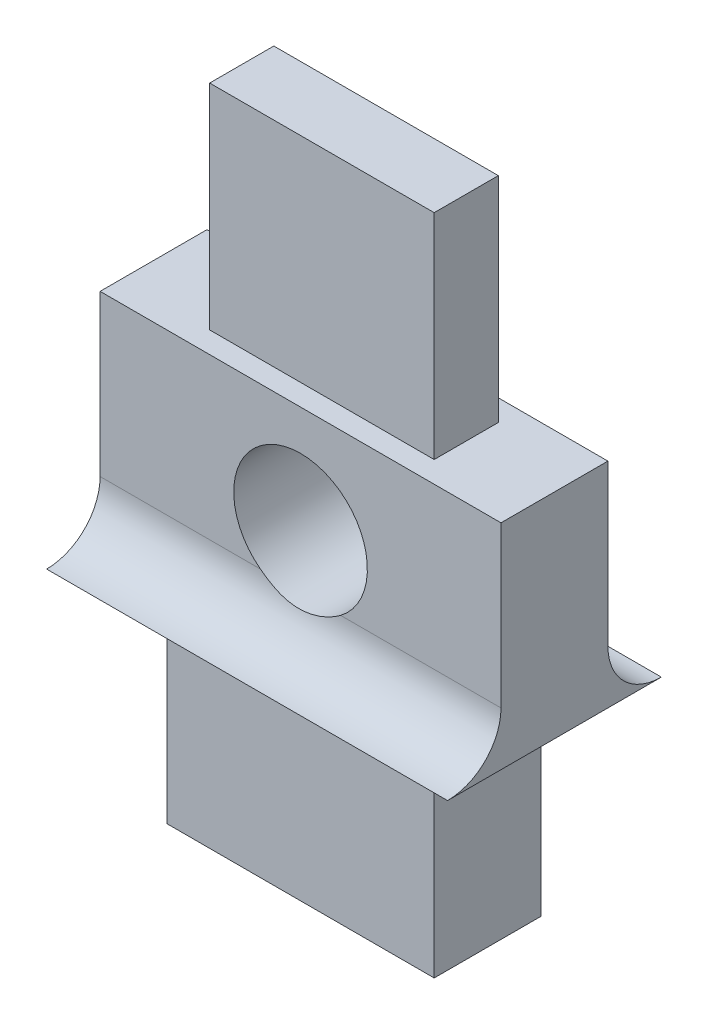
ISO-10303-21;
HEADER;
FILE_DESCRIPTION(('STEP AP214'),'2;1');
FILE_NAME('part.step','',(''),(''),'','','');
FILE_SCHEMA(('AUTOMOTIVE_DESIGN { 1 0 10303 214 1 1 1 1 }'));
ENDSEC;
DATA;
#1=APPLICATION_CONTEXT('core data for automotive mechanical design processes');
#2=APPLICATION_PROTOCOL_DEFINITION('international standard','automotive_design',2000,#1);
#3=PRODUCT_CONTEXT('',#1,'mechanical');
#4=PRODUCT('Part','Part','',(#3));
#5=PRODUCT_RELATED_PRODUCT_CATEGORY('part','',(#4));
#6=PRODUCT_DEFINITION_FORMATION('','',#4);
#7=PRODUCT_DEFINITION_CONTEXT('part definition',#1,'design');
#8=PRODUCT_DEFINITION('design','',#6,#7);
#9=PRODUCT_DEFINITION_SHAPE('','',#8);
#10=(LENGTH_UNIT() NAMED_UNIT(*) SI_UNIT(.MILLI.,.METRE.));
#11=(NAMED_UNIT(*) PLANE_ANGLE_UNIT() SI_UNIT($,.RADIAN.));
#12=(NAMED_UNIT(*) SI_UNIT($,.STERADIAN.) SOLID_ANGLE_UNIT());
#13=UNCERTAINTY_MEASURE_WITH_UNIT(LENGTH_MEASURE(1.E-05),#10,'distance_accuracy_value','');
#14=(GEOMETRIC_REPRESENTATION_CONTEXT(3) GLOBAL_UNCERTAINTY_ASSIGNED_CONTEXT((#13)) GLOBAL_UNIT_ASSIGNED_CONTEXT((#10,
#11,#12)) REPRESENTATION_CONTEXT('',''));
#15=CARTESIAN_POINT('',(0.,0.,0.));
#16=DIRECTION('',(0.,0.,1.));
#17=DIRECTION('',(1.,0.,0.));
#18=AXIS2_PLACEMENT_3D('',#15,#16,#17);
#19=CARTESIAN_POINT('',(0.,0.,0.));
#20=DIRECTION('',(0.,0.,-1.));
#21=DIRECTION('',(-1.,0.,0.));
#22=AXIS2_PLACEMENT_3D('',#19,#20,#21);
#23=PLANE('',#22);
#24=DIRECTION('',(0.,-1.,0.));
#25=VECTOR('',#24,1.);
#26=CARTESIAN_POINT('',(1950.92680872112,1462.88411595094,0.));
#27=LINE('',#26,#25);
#28=CARTESIAN_POINT('',(1950.92680872112,1462.88411595094,0.));
#29=VERTEX_POINT('',#28);
#30=CARTESIAN_POINT('',(1950.92680872112,1459.88411595094,0.));
#31=VERTEX_POINT('',#30);
#32=EDGE_CURVE('E296',#29,#31,#27,.T.);
#33=ORIENTED_EDGE('',*,*,#32,.F.);
#34=DIRECTION('',(-1.,0.,0.));
#35=VECTOR('',#34,1.);
#36=CARTESIAN_POINT('',(1957.17680872112,1462.88411595094,0.));
#37=LINE('',#36,#35);
#38=CARTESIAN_POINT('',(1958.42680872112,1462.88411595094,0.));
#39=VERTEX_POINT('',#38);
#40=EDGE_CURVE('E321',#39,#29,#37,.T.);
#41=ORIENTED_EDGE('',*,*,#40,.F.);
#42=DIRECTION('',(1.11022302462522E-13,1.,0.));
#43=VECTOR('',#42,1.);
#44=CARTESIAN_POINT('',(1958.42680872112,1462.88411595094,0.));
#45=LINE('',#44,#43);
#46=CARTESIAN_POINT('',(1958.42680872112,1459.88411595094,0.));
#47=VERTEX_POINT('',#46);
#48=EDGE_CURVE('E262',#47,#39,#45,.T.);
#49=ORIENTED_EDGE('',*,*,#48,.F.);
#50=DIRECTION('',(-1.,0.,0.));
#51=VECTOR('',#50,1.);
#52=CARTESIAN_POINT('',(1959.84102228349,1459.88411595094,0.));
#53=LINE('',#52,#51);
#54=CARTESIAN_POINT('',(1955.42680872111,1459.88411595094,0.));
#55=VERTEX_POINT('',#54);
#56=EDGE_CURVE('E299',#47,#55,#53,.T.);
#57=ORIENTED_EDGE('',*,*,#56,.T.);
#58=CARTESIAN_POINT('',(1954.67680872112,1460.88411595095,0.));
#59=DIRECTION('',(0.,0.,1.));
#60=DIRECTION('',(1.,0.,0.));
#61=AXIS2_PLACEMENT_3D('',#58,#59,#60);
#62=CIRCLE('',#61,1.24999999999997);
#63=CARTESIAN_POINT('',(1953.92680872112,1459.88411595094,0.));
#64=VERTEX_POINT('',#63);
#65=EDGE_CURVE('E313',#55,#64,#62,.T.);
#66=ORIENTED_EDGE('',*,*,#65,.T.);
#67=EDGE_CURVE('E55',#64,#31,#53,.T.);
#68=ORIENTED_EDGE('',*,*,#67,.T.);
#69=EDGE_LOOP('',(#33,#41,#49,#57,#66,#68));
#70=FACE_BOUND('',#69,.T.);
#71=ADVANCED_FACE('F32',(#70),#23,.T.);
#72=CARTESIAN_POINT('',(0.,0.,2.));
#73=DIRECTION('',(0.,0.,-1.));
#74=DIRECTION('',(-1.,0.,0.));
#75=AXIS2_PLACEMENT_3D('',#72,#73,#74);
#76=PLANE('',#75);
#77=DIRECTION('',(0.,1.,0.));
#78=VECTOR('',#77,1.);
#79=CARTESIAN_POINT('',(1957.17680872112,1458.88411595094,2.));
#80=LINE('',#79,#78);
#81=CARTESIAN_POINT('',(1957.17680872112,1454.88411595094,2.));
#82=VERTEX_POINT('',#81);
#83=CARTESIAN_POINT('',(1957.17680872112,1458.88411595094,2.));
#84=VERTEX_POINT('',#83);
#85=EDGE_CURVE('E328',#82,#84,#80,.T.);
#86=ORIENTED_EDGE('',*,*,#85,.T.);
#87=DIRECTION('',(-1.,0.,0.));
#88=VECTOR('',#87,1.);
#89=CARTESIAN_POINT('',(1959.84102228349,1458.88411595094,2.));
#90=LINE('',#89,#88);
#91=CARTESIAN_POINT('',(1952.17680872112,1458.88411595094,2.));
#92=VERTEX_POINT('',#91);
#93=EDGE_CURVE('E267',#84,#92,#90,.T.);
#94=ORIENTED_EDGE('',*,*,#93,.T.);
#95=DIRECTION('',(-2.22044604925031E-13,-1.,0.));
#96=VECTOR('',#95,1.);
#97=CARTESIAN_POINT('',(1952.17680872112,1458.88411595094,2.));
#98=LINE('',#97,#96);
#99=CARTESIAN_POINT('',(1952.17680872112,1454.88411595094,2.));
#100=VERTEX_POINT('',#99);
#101=EDGE_CURVE('E324',#92,#100,#98,.T.);
#102=ORIENTED_EDGE('',*,*,#101,.T.);
#103=DIRECTION('',(1.,0.,0.));
#104=VECTOR('',#103,1.);
#105=CARTESIAN_POINT('',(1952.17680872112,1454.88411595094,2.));
#106=LINE('',#105,#104);
#107=EDGE_CURVE('E326',#100,#82,#106,.T.);
#108=ORIENTED_EDGE('',*,*,#107,.T.);
#109=EDGE_LOOP('',(#86,#94,#102,#108));
#110=FACE_BOUND('',#109,.T.);
#111=ADVANCED_FACE('F219',(#110),#76,.F.);
#112=DIRECTION('',(1.11022302462522E-13,1.,0.));
#113=VECTOR('',#112,1.);
#114=CARTESIAN_POINT('',(1958.42680872112,1462.88411595094,2.));
#115=LINE('',#114,#113);
#116=CARTESIAN_POINT('',(1958.42680872112,1459.88411595094,2.));
#117=VERTEX_POINT('',#116);
#118=CARTESIAN_POINT('',(1958.42680872112,1462.88411595094,2.));
#119=VERTEX_POINT('',#118);
#120=EDGE_CURVE('E330',#117,#119,#115,.T.);
#121=ORIENTED_EDGE('',*,*,#120,.T.);
#122=DIRECTION('',(-1.,0.,0.));
#123=VECTOR('',#122,1.);
#124=CARTESIAN_POINT('',(1952.17680872112,1462.88411595094,2.));
#125=LINE('',#124,#123);
#126=CARTESIAN_POINT('',(1950.92680872112,1462.88411595094,2.));
#127=VERTEX_POINT('',#126);
#128=EDGE_CURVE('E318',#119,#127,#125,.T.);
#129=ORIENTED_EDGE('',*,*,#128,.T.);
#130=DIRECTION('',(0.,-1.,0.));
#131=VECTOR('',#130,1.);
#132=CARTESIAN_POINT('',(1950.92680872112,1462.88411595094,2.));
#133=LINE('',#132,#131);
#134=CARTESIAN_POINT('',(1950.92680872112,1459.88411595094,2.));
#135=VERTEX_POINT('',#134);
#136=EDGE_CURVE('E320',#127,#135,#133,.T.);
#137=ORIENTED_EDGE('',*,*,#136,.T.);
#138=DIRECTION('',(-1.,0.,0.));
#139=VECTOR('',#138,1.);
#140=CARTESIAN_POINT('',(1959.84102228349,1459.88411595094,2.));
#141=LINE('',#140,#139);
#142=CARTESIAN_POINT('',(1953.92680872112,1459.88411595094,2.));
#143=VERTEX_POINT('',#142);
#144=EDGE_CURVE('E309',#143,#135,#141,.T.);
#145=ORIENTED_EDGE('',*,*,#144,.F.);
#146=CARTESIAN_POINT('',(1954.67680872112,1460.88411595095,2.));
#147=DIRECTION('',(0.,0.,1.));
#148=DIRECTION('',(1.,0.,0.));
#149=AXIS2_PLACEMENT_3D('',#146,#147,#148);
#150=CIRCLE('',#149,1.24999999999997);
#151=CARTESIAN_POINT('',(1955.42680872111,1459.88411595094,2.00000000000006));
#152=VERTEX_POINT('',#151);
#153=EDGE_CURVE('E314',#152,#143,#150,.T.);
#154=ORIENTED_EDGE('',*,*,#153,.F.);
#155=EDGE_CURVE('E306',#117,#152,#141,.T.);
#156=ORIENTED_EDGE('',*,*,#155,.F.);
#157=EDGE_LOOP('',(#121,#129,#137,#145,#154,#156));
#158=FACE_BOUND('',#157,.T.);
#159=ADVANCED_FACE('F227',(#158),#76,.F.);
#160=DIRECTION('',(-1.,0.,0.));
#161=VECTOR('',#160,1.);
#162=CARTESIAN_POINT('',(1959.84102228349,1458.88411595094,0.));
#163=LINE('',#162,#161);
#164=CARTESIAN_POINT('',(1957.17680872112,1458.88411595094,0.));
#165=VERTEX_POINT('',#164);
#166=CARTESIAN_POINT('',(1952.17680872112,1458.88411595094,0.));
#167=VERTEX_POINT('',#166);
#168=EDGE_CURVE('E244',#165,#167,#163,.T.);
#169=ORIENTED_EDGE('',*,*,#168,.F.);
#170=DIRECTION('',(0.,1.,0.));
#171=VECTOR('',#170,1.);
#172=CARTESIAN_POINT('',(1957.17680872112,1458.88411595094,0.));
#173=LINE('',#172,#171);
#174=CARTESIAN_POINT('',(1957.17680872112,1454.88411595094,0.));
#175=VERTEX_POINT('',#174);
#176=EDGE_CURVE('E247',#175,#165,#173,.T.);
#177=ORIENTED_EDGE('',*,*,#176,.F.);
#178=DIRECTION('',(1.,0.,0.));
#179=VECTOR('',#178,1.);
#180=CARTESIAN_POINT('',(1952.17680872112,1454.88411595094,0.));
#181=LINE('',#180,#179);
#182=CARTESIAN_POINT('',(1952.17680872112,1454.88411595094,0.));
#183=VERTEX_POINT('',#182);
#184=EDGE_CURVE('E263',#183,#175,#181,.T.);
#185=ORIENTED_EDGE('',*,*,#184,.F.);
#186=DIRECTION('',(-2.22044604925031E-13,-1.,0.));
#187=VECTOR('',#186,1.);
#188=CARTESIAN_POINT('',(1952.17680872112,1458.88411595094,0.));
#189=LINE('',#188,#187);
#190=EDGE_CURVE('E248',#167,#183,#189,.T.);
#191=ORIENTED_EDGE('',*,*,#190,.F.);
#192=EDGE_LOOP('',(#169,#177,#185,#191));
#193=FACE_BOUND('',#192,.T.);
#194=ADVANCED_FACE('F221',(#193),#23,.T.);
#195=CARTESIAN_POINT('',(1950.92680872112,1462.88411595094,2.));
#196=DIRECTION('',(1.,0.,0.));
#197=DIRECTION('',(0.,0.,-1.));
#198=AXIS2_PLACEMENT_3D('',#195,#196,#197);
#199=PLANE('',#198);
#200=ORIENTED_EDGE('',*,*,#32,.T.);
#201=CARTESIAN_POINT('',(1950.92680872112,1459.88411595094,-1.));
#202=DIRECTION('',(1.,0.,0.));
#203=DIRECTION('',(0.,0.,-1.));
#204=AXIS2_PLACEMENT_3D('',#201,#202,#203);
#205=CIRCLE('',#204,0.999999999999945);
#206=CARTESIAN_POINT('',(1950.92680872112,1458.88411595094,-1.));
#207=VERTEX_POINT('',#206);
#208=EDGE_CURVE('E291',#31,#207,#205,.T.);
#209=ORIENTED_EDGE('',*,*,#208,.T.);
#210=DIRECTION('',(0.,0.,-1.));
#211=VECTOR('',#210,1.);
#212=CARTESIAN_POINT('',(1950.92680872112,1458.88411595094,2.));
#213=LINE('',#212,#211);
#214=CARTESIAN_POINT('',(1950.92680872112,1458.88411595094,3.));
#215=VERTEX_POINT('',#214);
#216=EDGE_CURVE('E40',#215,#207,#213,.T.);
#217=ORIENTED_EDGE('',*,*,#216,.F.);
#218=CARTESIAN_POINT('',(1950.92680872112,1459.88411595094,3.));
#219=DIRECTION('',(1.,0.,0.));
#220=DIRECTION('',(0.,0.,1.));
#221=AXIS2_PLACEMENT_3D('',#218,#219,#220);
#222=CIRCLE('',#221,0.999999999999945);
#223=EDGE_CURVE('E302',#215,#135,#222,.T.);
#224=ORIENTED_EDGE('',*,*,#223,.T.);
#225=ORIENTED_EDGE('',*,*,#136,.F.);
#226=DIRECTION('',(0.,0.,-1.));
#227=VECTOR('',#226,1.);
#228=CARTESIAN_POINT('',(1950.92680872112,1462.88411595094,2.));
#229=LINE('',#228,#227);
#230=EDGE_CURVE('E11',#127,#29,#229,.T.);
#231=ORIENTED_EDGE('',*,*,#230,.T.);
#232=EDGE_LOOP('',(#200,#209,#217,#224,#225,#231));
#233=FACE_BOUND('',#232,.T.);
#234=ADVANCED_FACE('F232',(#233),#199,.F.);
#235=CARTESIAN_POINT('',(1952.17680872112,1458.88411595094,2.));
#236=DIRECTION('',(1.,-2.22044604925031E-13,0.));
#237=DIRECTION('',(2.22044604925031E-13,1.,0.));
#238=AXIS2_PLACEMENT_3D('',#235,#236,#237);
#239=PLANE('',#238);
#240=ORIENTED_EDGE('',*,*,#190,.T.);
#241=DIRECTION('',(0.,0.,-1.));
#242=VECTOR('',#241,1.);
#243=CARTESIAN_POINT('',(1952.17680872112,1454.88411595094,2.));
#244=LINE('',#243,#242);
#245=EDGE_CURVE('E271',#100,#183,#244,.T.);
#246=ORIENTED_EDGE('',*,*,#245,.F.);
#247=ORIENTED_EDGE('',*,*,#101,.F.);
#248=DIRECTION('',(0.,0.,-1.));
#249=VECTOR('',#248,1.);
#250=CARTESIAN_POINT('',(1952.17680872112,1458.88411595094,2.));
#251=LINE('',#250,#249);
#252=EDGE_CURVE('E279',#92,#167,#251,.T.);
#253=ORIENTED_EDGE('',*,*,#252,.T.);
#254=EDGE_LOOP('',(#240,#246,#247,#253));
#255=FACE_BOUND('',#254,.T.);
#256=ADVANCED_FACE('F238',(#255),#239,.F.);
#257=CARTESIAN_POINT('',(1952.17680872112,1454.88411595094,2.));
#258=DIRECTION('',(0.,1.,0.));
#259=DIRECTION('',(0.,0.,1.));
#260=AXIS2_PLACEMENT_3D('',#257,#258,#259);
#261=PLANE('',#260);
#262=ORIENTED_EDGE('',*,*,#184,.T.);
#263=DIRECTION('',(0.,0.,-1.));
#264=VECTOR('',#263,1.);
#265=CARTESIAN_POINT('',(1957.17680872112,1454.88411595094,2.));
#266=LINE('',#265,#264);
#267=EDGE_CURVE('E261',#82,#175,#266,.T.);
#268=ORIENTED_EDGE('',*,*,#267,.F.);
#269=ORIENTED_EDGE('',*,*,#107,.F.);
#270=ORIENTED_EDGE('',*,*,#245,.T.);
#271=EDGE_LOOP('',(#262,#268,#269,#270));
#272=FACE_BOUND('',#271,.T.);
#273=ADVANCED_FACE('F372',(#272),#261,.F.);
#274=CARTESIAN_POINT('',(1957.17680872112,1458.88411595094,2.));
#275=DIRECTION('',(-1.,0.,0.));
#276=DIRECTION('',(0.,0.,1.));
#277=AXIS2_PLACEMENT_3D('',#274,#275,#276);
#278=PLANE('',#277);
#279=ORIENTED_EDGE('',*,*,#176,.T.);
#280=DIRECTION('',(0.,0.,-1.));
#281=VECTOR('',#280,1.);
#282=CARTESIAN_POINT('',(1957.17680872112,1458.88411595094,2.));
#283=LINE('',#282,#281);
#284=EDGE_CURVE('E259',#84,#165,#283,.T.);
#285=ORIENTED_EDGE('',*,*,#284,.F.);
#286=ORIENTED_EDGE('',*,*,#85,.F.);
#287=ORIENTED_EDGE('',*,*,#267,.T.);
#288=EDGE_LOOP('',(#279,#285,#286,#287));
#289=FACE_BOUND('',#288,.T.);
#290=ADVANCED_FACE('F257',(#289),#278,.F.);
#291=CARTESIAN_POINT('',(1957.17680872112,1458.88411595094,2.));
#292=DIRECTION('',(0.,1.,0.));
#293=DIRECTION('',(0.,0.,1.));
#294=AXIS2_PLACEMENT_3D('',#291,#292,#293);
#295=PLANE('',#294);
#296=ORIENTED_EDGE('',*,*,#168,.T.);
#297=ORIENTED_EDGE('',*,*,#252,.F.);
#298=ORIENTED_EDGE('',*,*,#93,.F.);
#299=ORIENTED_EDGE('',*,*,#284,.T.);
#300=EDGE_LOOP('',(#296,#297,#298,#299));
#301=FACE_BOUND('',#300,.T.);
#302=ORIENTED_EDGE('',*,*,#216,.T.);
#303=DIRECTION('',(-1.,0.,0.));
#304=VECTOR('',#303,1.);
#305=CARTESIAN_POINT('',(1959.84102228349,1458.88411595094,-1.));
#306=LINE('',#305,#304);
#307=CARTESIAN_POINT('',(1958.42680872112,1458.88411595094,-1.));
#308=VERTEX_POINT('',#307);
#309=EDGE_CURVE('E252',#308,#207,#306,.T.);
#310=ORIENTED_EDGE('',*,*,#309,.F.);
#311=DIRECTION('',(0.,0.,-1.));
#312=VECTOR('',#311,1.);
#313=CARTESIAN_POINT('',(1958.42680872112,1458.88411595094,2.));
#314=LINE('',#313,#312);
#315=CARTESIAN_POINT('',(1958.42680872112,1458.88411595094,3.));
#316=VERTEX_POINT('',#315);
#317=EDGE_CURVE('E269',#316,#308,#314,.T.);
#318=ORIENTED_EDGE('',*,*,#317,.F.);
#319=DIRECTION('',(-1.,0.,0.));
#320=VECTOR('',#319,1.);
#321=CARTESIAN_POINT('',(1959.84102228349,1458.88411595094,3.));
#322=LINE('',#321,#320);
#323=EDGE_CURVE('E284',#316,#215,#322,.T.);
#324=ORIENTED_EDGE('',*,*,#323,.T.);
#325=EDGE_LOOP('',(#302,#310,#318,#324));
#326=FACE_BOUND('',#325,.T.);
#327=ADVANCED_FACE('F265',(#301,#326),#295,.F.);
#328=CARTESIAN_POINT('',(1958.42680872112,1462.88411595094,2.));
#329=DIRECTION('',(-1.,1.11022302462522E-13,0.));
#330=DIRECTION('',(-1.11022302462522E-13,-1.,0.));
#331=AXIS2_PLACEMENT_3D('',#328,#329,#330);
#332=PLANE('',#331);
#333=ORIENTED_EDGE('',*,*,#317,.T.);
#334=CARTESIAN_POINT('',(1958.42680872112,1459.88411595094,-1.));
#335=DIRECTION('',(-1.,1.11022302462522E-13,0.));
#336=DIRECTION('',(-1.11022302462522E-13,-1.,0.));
#337=AXIS2_PLACEMENT_3D('',#334,#335,#336);
#338=CIRCLE('',#337,0.999999999999945);
#339=EDGE_CURVE('E294',#308,#47,#338,.T.);
#340=ORIENTED_EDGE('',*,*,#339,.T.);
#341=ORIENTED_EDGE('',*,*,#48,.T.);
#342=DIRECTION('',(0.,0.,-1.));
#343=VECTOR('',#342,1.);
#344=CARTESIAN_POINT('',(1958.42680872112,1462.88411595094,2.));
#345=LINE('',#344,#343);
#346=EDGE_CURVE('E273',#119,#39,#345,.T.);
#347=ORIENTED_EDGE('',*,*,#346,.F.);
#348=ORIENTED_EDGE('',*,*,#120,.F.);
#349=CARTESIAN_POINT('',(1958.42680872112,1459.88411595094,3.));
#350=DIRECTION('',(-1.,1.11022302462522E-13,0.));
#351=DIRECTION('',(-1.11022302462522E-13,-1.,0.));
#352=AXIS2_PLACEMENT_3D('',#349,#350,#351);
#353=CIRCLE('',#352,0.999999999999945);
#354=EDGE_CURVE('E305',#117,#316,#353,.T.);
#355=ORIENTED_EDGE('',*,*,#354,.T.);
#356=EDGE_LOOP('',(#333,#340,#341,#347,#348,#355));
#357=FACE_BOUND('',#356,.T.);
#358=ADVANCED_FACE('F344',(#357),#332,.F.);
#359=CARTESIAN_POINT('',(1957.17680872112,1462.88411595094,2.));
#360=DIRECTION('',(0.,-1.,0.));
#361=DIRECTION('',(0.,0.,-1.));
#362=AXIS2_PLACEMENT_3D('',#359,#360,#361);
#363=PLANE('',#362);
#364=ORIENTED_EDGE('',*,*,#40,.T.);
#365=ORIENTED_EDGE('',*,*,#230,.F.);
#366=ORIENTED_EDGE('',*,*,#128,.F.);
#367=ORIENTED_EDGE('',*,*,#346,.T.);
#368=EDGE_LOOP('',(#364,#365,#366,#367));
#369=FACE_BOUND('',#368,.T.);
#370=DIRECTION('',(0.,0.,1.));
#371=VECTOR('',#370,1.);
#372=CARTESIAN_POINT('',(1952.57680872112,1462.88411595094,1.6));
#373=LINE('',#372,#371);
#374=CARTESIAN_POINT('',(1952.57680872112,1462.88411595094,0.4));
#375=VERTEX_POINT('',#374);
#376=CARTESIAN_POINT('',(1952.57680872112,1462.88411595094,1.6));
#377=VERTEX_POINT('',#376);
#378=EDGE_CURVE('E165',#375,#377,#373,.T.);
#379=ORIENTED_EDGE('',*,*,#378,.F.);
#380=DIRECTION('',(-1.,0.,0.));
#381=VECTOR('',#380,1.);
#382=CARTESIAN_POINT('',(1952.57680872112,1462.88411595094,0.4));
#383=LINE('',#382,#381);
#384=CARTESIAN_POINT('',(1956.77680872112,1462.88411595094,0.4));
#385=VERTEX_POINT('',#384);
#386=EDGE_CURVE('E159',#385,#375,#383,.T.);
#387=ORIENTED_EDGE('',*,*,#386,.F.);
#388=DIRECTION('',(0.,0.,-1.));
#389=VECTOR('',#388,1.);
#390=CARTESIAN_POINT('',(1956.77680872112,1462.88411595094,1.6));
#391=LINE('',#390,#389);
#392=CARTESIAN_POINT('',(1956.77680872112,1462.88411595094,1.6));
#393=VERTEX_POINT('',#392);
#394=EDGE_CURVE('E168',#393,#385,#391,.T.);
#395=ORIENTED_EDGE('',*,*,#394,.F.);
#396=DIRECTION('',(1.,0.,0.));
#397=VECTOR('',#396,1.);
#398=CARTESIAN_POINT('',(1952.57680872112,1462.88411595094,1.6));
#399=LINE('',#398,#397);
#400=EDGE_CURVE('E151',#377,#393,#399,.T.);
#401=ORIENTED_EDGE('',*,*,#400,.F.);
#402=EDGE_LOOP('',(#379,#387,#395,#401));
#403=FACE_BOUND('',#402,.T.);
#404=ADVANCED_FACE('F163',(#369,#403),#363,.F.);
#405=CARTESIAN_POINT('',(1954.67680872112,1460.88411595095,2.));
#406=DIRECTION('',(0.,0.,-1.));
#407=DIRECTION('',(-1.,0.,0.));
#408=AXIS2_PLACEMENT_3D('',#405,#406,#407);
#409=CYLINDRICAL_SURFACE('',#408,1.24999999999997);
#410=ORIENTED_EDGE('',*,*,#153,.T.);
#411=CARTESIAN_POINT('',(1953.92680872112,1459.88411595094,2.00000000000006));
#412=CARTESIAN_POINT('',(1953.95464186426,1459.86324053161,2.00000413601019));
#413=CARTESIAN_POINT('',(1953.98332445631,1459.84354558404,2.00065286249592));
#414=CARTESIAN_POINT('',(1954.04219362052,1459.80663247636,2.00283435504111));
#415=CARTESIAN_POINT('',(1954.07237951385,1459.78941321175,2.00436672532793));
#416=CARTESIAN_POINT('',(1954.16493643226,1459.74161719196,2.00968314842704));
#417=CARTESIAN_POINT('',(1954.22930871718,1459.71490069901,2.01418657178201));
#418=CARTESIAN_POINT('',(1954.36159209563,1459.67251971499,2.02240246556453));
#419=CARTESIAN_POINT('',(1954.42950212547,1459.65685192226,2.02611517204895));
#420=CARTESIAN_POINT('',(1954.56700929288,1459.63701636227,2.03095427102973));
#421=CARTESIAN_POINT('',(1954.63660414283,1459.63283379689,2.03208399125503));
#422=CARTESIAN_POINT('',(1954.77504472976,1459.63607168941,2.03125053742804));
#423=CARTESIAN_POINT('',(1954.84389239719,1459.64341702368,2.02930738765252));
#424=CARTESIAN_POINT('',(1954.97939950408,1459.66933001508,2.02324979340273));
#425=CARTESIAN_POINT('',(1955.04605666205,1459.68790900477,2.01913315683881));
#426=CARTESIAN_POINT('',(1955.16719027573,1459.7327467703,2.01129786180112));
#427=CARTESIAN_POINT('',(1955.2221396564,1459.75773340367,2.00759490859268));
#428=CARTESIAN_POINT('',(1955.30142399057,1459.80094387527,2.00336036664711));
#429=CARTESIAN_POINT('',(1955.32731779593,1459.816294206,2.00216907514131));
#430=CARTESIAN_POINT('',(1955.3779580889,1459.84884011021,2.00048997066709));
#431=CARTESIAN_POINT('',(1955.40270404076,1459.86603653315,2.00000248305203));
#432=CARTESIAN_POINT('',(1955.42680872111,1459.88411595094,2.00000000000006));
#433=B_SPLINE_CURVE_WITH_KNOTS('',3,(#411,#412,#413,#414,#415,#416,#417,#418,#419,#420,#421,
#422,#423,#424,#425,#426,#427,#428,#429,#430,#431,#432),.UNSPECIFIED.,.F.,.F.,(4,2,2,2,2,2,2,2,
2,2,4),(0.,0.104289480114433,0.208532286557596,0.417010423227884,0.625426234310823,
0.833573386174511,1.04036973220732,1.24737504408885,1.42813829488587,1.51843817128817,
1.60877977802348),.UNSPECIFIED.);
#434=EDGE_CURVE('E194',#143,#152,#433,.T.);
#435=ORIENTED_EDGE('',*,*,#434,.T.);
#436=EDGE_LOOP('',(#410,#435));
#437=FACE_BOUND('',#436,.T.);
#438=ORIENTED_EDGE('',*,*,#65,.F.);
#439=CARTESIAN_POINT('',(1955.42680872111,1459.88411595094,0.));
#440=CARTESIAN_POINT('',(1955.39897557797,1459.86324053161,-4.13601018518848E-06));
#441=CARTESIAN_POINT('',(1955.37029298592,1459.84354558404,-0.00065286249591931));
#442=CARTESIAN_POINT('',(1955.31142382171,1459.80663247636,-0.00283435504112357));
#443=CARTESIAN_POINT('',(1955.28123792838,1459.78941321175,-0.00436672532794736));
#444=CARTESIAN_POINT('',(1955.18868100997,1459.74161719196,-0.00968314842705621));
#445=CARTESIAN_POINT('',(1955.12430872505,1459.71490069901,-0.0141865717820136));
#446=CARTESIAN_POINT('',(1954.9920253466,1459.67251971499,-0.0224024655645303));
#447=CARTESIAN_POINT('',(1954.92411531676,1459.65685192226,-0.0261151720489534));
#448=CARTESIAN_POINT('',(1954.78660814936,1459.63701636227,-0.0309542710297293));
#449=CARTESIAN_POINT('',(1954.71701329941,1459.63283379689,-0.0320839912550294));
#450=CARTESIAN_POINT('',(1954.57857271248,1459.63607168941,-0.0312505374280387));
#451=CARTESIAN_POINT('',(1954.50972504504,1459.64341702368,-0.0293073876525235));
#452=CARTESIAN_POINT('',(1954.37421793816,1459.66933001508,-0.0232497934027292));
#453=CARTESIAN_POINT('',(1954.30756078018,1459.68790900477,-0.0191331568388102));
#454=CARTESIAN_POINT('',(1954.18642716651,1459.7327467703,-0.0112978618011222));
#455=CARTESIAN_POINT('',(1954.13147778584,1459.75773340367,-0.00759490859268298));
#456=CARTESIAN_POINT('',(1954.05219345166,1459.80094387527,-0.00336036664711868));
#457=CARTESIAN_POINT('',(1954.0262996463,1459.816294206,-0.00216907514131567));
#458=CARTESIAN_POINT('',(1953.97565935334,1459.84884011021,-0.000489970667087416));
#459=CARTESIAN_POINT('',(1953.95091340147,1459.86603653315,-2.48305202246684E-06));
#460=CARTESIAN_POINT('',(1953.92680872112,1459.88411595094,0.));
#461=B_SPLINE_CURVE_WITH_KNOTS('',3,(#439,#440,#441,#442,#443,#444,#445,#446,#447,#448,#449,
#450,#451,#452,#453,#454,#455,#456,#457,#458,#459,#460),.UNSPECIFIED.,.F.,.F.,(4,2,2,2,2,2,2,2,
2,2,4),(0.,0.104289480114742,0.208532286557905,0.417010423227902,0.625426234311108,
0.833573386174561,1.04036973220737,1.2473750440889,1.42813829488592,1.51843817128772,
1.60877977802353),.UNSPECIFIED.);
#462=EDGE_CURVE('E184',#55,#64,#461,.T.);
#463=ORIENTED_EDGE('',*,*,#462,.T.);
#464=EDGE_LOOP('',(#438,#463));
#465=FACE_BOUND('',#464,.T.);
#466=ADVANCED_FACE('F347',(#437,#465),#409,.F.);
#467=CARTESIAN_POINT('',(1959.84102228349,1459.88411595094,3.));
#468=DIRECTION('',(-1.,0.,0.));
#469=DIRECTION('',(0.,0.,1.));
#470=AXIS2_PLACEMENT_3D('',#467,#468,#469);
#471=CYLINDRICAL_SURFACE('',#470,0.999999999999945);
#472=ORIENTED_EDGE('',*,*,#434,.F.);
#473=ORIENTED_EDGE('',*,*,#144,.T.);
#474=ORIENTED_EDGE('',*,*,#223,.F.);
#475=ORIENTED_EDGE('',*,*,#323,.F.);
#476=ORIENTED_EDGE('',*,*,#354,.F.);
#477=ORIENTED_EDGE('',*,*,#155,.T.);
#478=EDGE_LOOP('',(#472,#473,#474,#475,#476,#477));
#479=FACE_BOUND('',#478,.T.);
#480=ADVANCED_FACE('F349',(#479),#471,.F.);
#481=CARTESIAN_POINT('',(1959.84102228349,1459.88411595094,-1.));
#482=DIRECTION('',(-1.,0.,0.));
#483=DIRECTION('',(0.,0.,1.));
#484=AXIS2_PLACEMENT_3D('',#481,#482,#483);
#485=CYLINDRICAL_SURFACE('',#484,0.999999999999945);
#486=ORIENTED_EDGE('',*,*,#462,.F.);
#487=ORIENTED_EDGE('',*,*,#56,.F.);
#488=ORIENTED_EDGE('',*,*,#339,.F.);
#489=ORIENTED_EDGE('',*,*,#309,.T.);
#490=ORIENTED_EDGE('',*,*,#208,.F.);
#491=ORIENTED_EDGE('',*,*,#67,.F.);
#492=EDGE_LOOP('',(#486,#487,#488,#489,#490,#491));
#493=FACE_BOUND('',#492,.T.);
#494=ADVANCED_FACE('F200',(#493),#485,.F.);
#495=CARTESIAN_POINT('',(1952.57680872112,1462.88411595094,1.6));
#496=DIRECTION('',(-1.,0.,0.));
#497=DIRECTION('',(0.,0.,1.));
#498=AXIS2_PLACEMENT_3D('',#495,#496,#497);
#499=PLANE('',#498);
#500=DIRECTION('',(0.,0.,1.));
#501=VECTOR('',#500,1.);
#502=CARTESIAN_POINT('',(1952.57680872112,1466.88411595094,1.6));
#503=LINE('',#502,#501);
#504=CARTESIAN_POINT('',(1952.57680872112,1466.88411595094,0.4));
#505=VERTEX_POINT('',#504);
#506=CARTESIAN_POINT('',(1952.57680872112,1466.88411595094,1.6));
#507=VERTEX_POINT('',#506);
#508=EDGE_CURVE('E179',#505,#507,#503,.T.);
#509=ORIENTED_EDGE('',*,*,#508,.F.);
#510=DIRECTION('',(0.,1.,0.));
#511=VECTOR('',#510,1.);
#512=CARTESIAN_POINT('',(1952.57680872112,1462.88411595094,0.4));
#513=LINE('',#512,#511);
#514=EDGE_CURVE('E171',#375,#505,#513,.T.);
#515=ORIENTED_EDGE('',*,*,#514,.F.);
#516=ORIENTED_EDGE('',*,*,#378,.T.);
#517=DIRECTION('',(0.,1.,0.));
#518=VECTOR('',#517,1.);
#519=CARTESIAN_POINT('',(1952.57680872112,1462.88411595094,1.6));
#520=LINE('',#519,#518);
#521=EDGE_CURVE('E148',#377,#507,#520,.T.);
#522=ORIENTED_EDGE('',*,*,#521,.T.);
#523=EDGE_LOOP('',(#509,#515,#516,#522));
#524=FACE_BOUND('',#523,.T.);
#525=ADVANCED_FACE('F170',(#524),#499,.T.);
#526=CARTESIAN_POINT('',(1952.57680872112,1462.88411595094,0.4));
#527=DIRECTION('',(0.,0.,-1.));
#528=DIRECTION('',(-1.,0.,0.));
#529=AXIS2_PLACEMENT_3D('',#526,#527,#528);
#530=PLANE('',#529);
#531=DIRECTION('',(-1.,0.,0.));
#532=VECTOR('',#531,1.);
#533=CARTESIAN_POINT('',(1952.57680872112,1466.88411595094,0.4));
#534=LINE('',#533,#532);
#535=CARTESIAN_POINT('',(1956.77680872112,1466.88411595094,0.4));
#536=VERTEX_POINT('',#535);
#537=EDGE_CURVE('E172',#536,#505,#534,.T.);
#538=ORIENTED_EDGE('',*,*,#537,.F.);
#539=DIRECTION('',(0.,1.,0.));
#540=VECTOR('',#539,1.);
#541=CARTESIAN_POINT('',(1956.77680872112,1462.88411595094,0.4));
#542=LINE('',#541,#540);
#543=EDGE_CURVE('E185',#385,#536,#542,.T.);
#544=ORIENTED_EDGE('',*,*,#543,.F.);
#545=ORIENTED_EDGE('',*,*,#386,.T.);
#546=ORIENTED_EDGE('',*,*,#514,.T.);
#547=EDGE_LOOP('',(#538,#544,#545,#546));
#548=FACE_BOUND('',#547,.T.);
#549=ADVANCED_FACE('F207',(#548),#530,.T.);
#550=CARTESIAN_POINT('',(1956.77680872112,1462.88411595094,1.6));
#551=DIRECTION('',(1.,0.,0.));
#552=DIRECTION('',(0.,0.,-1.));
#553=AXIS2_PLACEMENT_3D('',#550,#551,#552);
#554=PLANE('',#553);
#555=DIRECTION('',(0.,0.,-1.));
#556=VECTOR('',#555,1.);
#557=CARTESIAN_POINT('',(1956.77680872112,1466.88411595094,1.6));
#558=LINE('',#557,#556);
#559=CARTESIAN_POINT('',(1956.77680872112,1466.88411595094,1.6));
#560=VERTEX_POINT('',#559);
#561=EDGE_CURVE('E47',#560,#536,#558,.T.);
#562=ORIENTED_EDGE('',*,*,#561,.F.);
#563=DIRECTION('',(0.,1.,0.));
#564=VECTOR('',#563,1.);
#565=CARTESIAN_POINT('',(1956.77680872112,1462.88411595094,1.6));
#566=LINE('',#565,#564);
#567=EDGE_CURVE('E158',#393,#560,#566,.T.);
#568=ORIENTED_EDGE('',*,*,#567,.F.);
#569=ORIENTED_EDGE('',*,*,#394,.T.);
#570=ORIENTED_EDGE('',*,*,#543,.T.);
#571=EDGE_LOOP('',(#562,#568,#569,#570));
#572=FACE_BOUND('',#571,.T.);
#573=ADVANCED_FACE('F210',(#572),#554,.T.);
#574=CARTESIAN_POINT('',(1952.57680872112,1462.88411595094,1.6));
#575=DIRECTION('',(0.,0.,1.));
#576=DIRECTION('',(1.,0.,0.));
#577=AXIS2_PLACEMENT_3D('',#574,#575,#576);
#578=PLANE('',#577);
#579=DIRECTION('',(1.,0.,0.));
#580=VECTOR('',#579,1.);
#581=CARTESIAN_POINT('',(1952.57680872112,1466.88411595094,1.6));
#582=LINE('',#581,#580);
#583=EDGE_CURVE('E153',#507,#560,#582,.T.);
#584=ORIENTED_EDGE('',*,*,#583,.F.);
#585=ORIENTED_EDGE('',*,*,#521,.F.);
#586=ORIENTED_EDGE('',*,*,#400,.T.);
#587=ORIENTED_EDGE('',*,*,#567,.T.);
#588=EDGE_LOOP('',(#584,#585,#586,#587));
#589=FACE_BOUND('',#588,.T.);
#590=ADVANCED_FACE('F150',(#589),#578,.T.);
#591=CARTESIAN_POINT('',(1952.17680872112,1466.88411595094,2.));
#592=DIRECTION('',(0.,-1.,0.));
#593=DIRECTION('',(0.,0.,-1.));
#594=AXIS2_PLACEMENT_3D('',#591,#592,#593);
#595=PLANE('',#594);
#596=ORIENTED_EDGE('',*,*,#508,.T.);
#597=ORIENTED_EDGE('',*,*,#583,.T.);
#598=ORIENTED_EDGE('',*,*,#561,.T.);
#599=ORIENTED_EDGE('',*,*,#537,.T.);
#600=EDGE_LOOP('',(#596,#597,#598,#599));
#601=FACE_BOUND('',#600,.T.);
#602=ADVANCED_FACE('F34',(#601),#595,.F.);
#603=CLOSED_SHELL('',(#71,#111,#159,#194,#234,#256,#273,#290,#327,#358,#404,#466,#480,#494,#525,
#549,#573,#590,#602));
#604=MANIFOLD_SOLID_BREP('B2',#603);
#605=ADVANCED_BREP_SHAPE_REPRESENTATION('',(#18,#604),#14);
#606=SHAPE_DEFINITION_REPRESENTATION(#9,#605);
ENDSEC;
END-ISO-10303-21;
